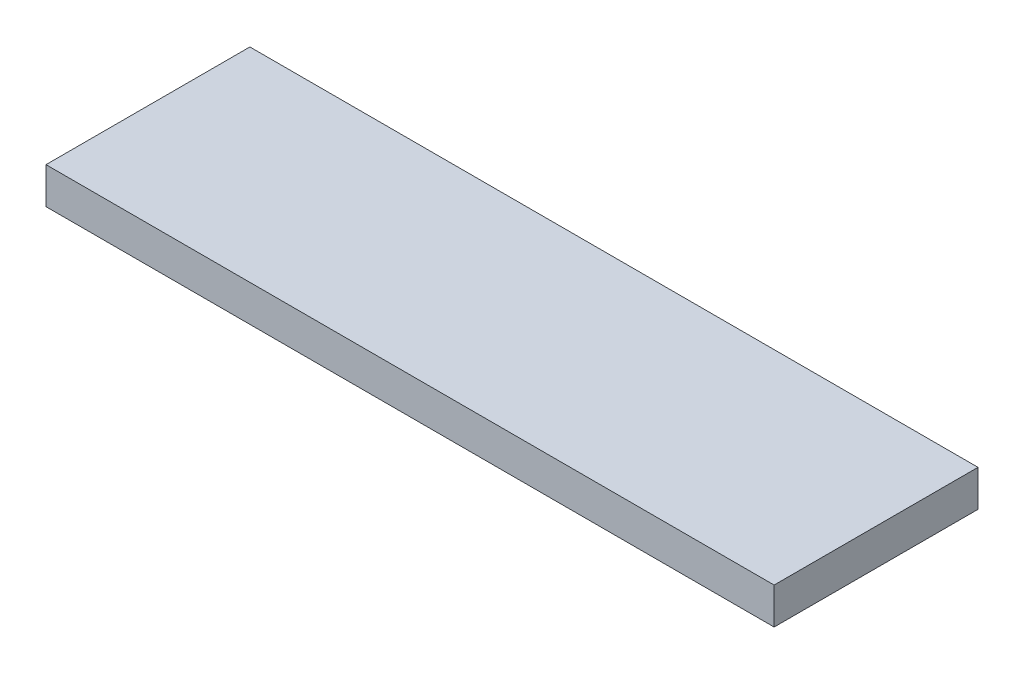
ISO-10303-21;
HEADER;
FILE_DESCRIPTION(('STEP AP214'),'2;1');
FILE_NAME('part.step','',(''),(''),'','','');
FILE_SCHEMA(('AUTOMOTIVE_DESIGN { 1 0 10303 214 1 1 1 1 }'));
ENDSEC;
DATA;
#1=APPLICATION_CONTEXT('core data for automotive mechanical design processes');
#2=APPLICATION_PROTOCOL_DEFINITION('international standard','automotive_design',2000,#1);
#3=PRODUCT_CONTEXT('',#1,'mechanical');
#4=PRODUCT('Part','Part','',(#3));
#5=PRODUCT_RELATED_PRODUCT_CATEGORY('part','',(#4));
#6=PRODUCT_DEFINITION_FORMATION('','',#4);
#7=PRODUCT_DEFINITION_CONTEXT('part definition',#1,'design');
#8=PRODUCT_DEFINITION('design','',#6,#7);
#9=PRODUCT_DEFINITION_SHAPE('','',#8);
#10=(LENGTH_UNIT() NAMED_UNIT(*) SI_UNIT(.MILLI.,.METRE.));
#11=(NAMED_UNIT(*) PLANE_ANGLE_UNIT() SI_UNIT($,.RADIAN.));
#12=(NAMED_UNIT(*) SI_UNIT($,.STERADIAN.) SOLID_ANGLE_UNIT());
#13=UNCERTAINTY_MEASURE_WITH_UNIT(LENGTH_MEASURE(1.E-05),#10,'distance_accuracy_value','');
#14=(GEOMETRIC_REPRESENTATION_CONTEXT(3) GLOBAL_UNCERTAINTY_ASSIGNED_CONTEXT((#13)) GLOBAL_UNIT_ASSIGNED_CONTEXT((#10,
#11,#12)) REPRESENTATION_CONTEXT('',''));
#15=CARTESIAN_POINT('',(0.,0.,0.));
#16=DIRECTION('',(0.,0.,1.));
#17=DIRECTION('',(1.,0.,0.));
#18=AXIS2_PLACEMENT_3D('',#15,#16,#17);
#19=CARTESIAN_POINT('',(9.8,2.22,3.));
#20=DIRECTION('',(-1.,0.,0.));
#21=DIRECTION('',(0.,0.,1.));
#22=AXIS2_PLACEMENT_3D('',#19,#20,#21);
#23=PLANE('',#22);
#24=DIRECTION('',(0.,0.,-1.));
#25=VECTOR('',#24,1.);
#26=CARTESIAN_POINT('',(9.8,2.22,3.));
#27=LINE('',#26,#25);
#28=CARTESIAN_POINT('',(9.8,2.22,3.));
#29=VERTEX_POINT('',#28);
#30=CARTESIAN_POINT('',(9.8,2.22,-1.2));
#31=VERTEX_POINT('',#30);
#32=EDGE_CURVE('E86',#29,#31,#27,.T.);
#33=ORIENTED_EDGE('',*,*,#32,.T.);
#34=DIRECTION('',(0.,-1.,0.));
#35=VECTOR('',#34,1.);
#36=CARTESIAN_POINT('',(9.8,2.22,-1.2));
#37=LINE('',#36,#35);
#38=CARTESIAN_POINT('',(9.8,1.47,-1.2));
#39=VERTEX_POINT('',#38);
#40=EDGE_CURVE('E11',#31,#39,#37,.T.);
#41=ORIENTED_EDGE('',*,*,#40,.T.);
#42=DIRECTION('',(0.,0.,-1.));
#43=VECTOR('',#42,1.);
#44=CARTESIAN_POINT('',(9.8,1.47,3.));
#45=LINE('',#44,#43);
#46=CARTESIAN_POINT('',(9.8,1.47,3.));
#47=VERTEX_POINT('',#46);
#48=EDGE_CURVE('E102',#47,#39,#45,.T.);
#49=ORIENTED_EDGE('',*,*,#48,.F.);
#50=DIRECTION('',(0.,-1.,0.));
#51=VECTOR('',#50,1.);
#52=CARTESIAN_POINT('',(9.8,2.22,3.));
#53=LINE('',#52,#51);
#54=EDGE_CURVE('E89',#29,#47,#53,.T.);
#55=ORIENTED_EDGE('',*,*,#54,.F.);
#56=EDGE_LOOP('',(#33,#41,#49,#55));
#57=FACE_BOUND('',#56,.T.);
#58=ADVANCED_FACE('F16',(#57),#23,.T.);
#59=CARTESIAN_POINT('',(9.8,2.22,-1.2));
#60=DIRECTION('',(0.,0.,-1.));
#61=DIRECTION('',(0.,-1.,0.));
#62=AXIS2_PLACEMENT_3D('',#59,#60,#61);
#63=PLANE('',#62);
#64=DIRECTION('',(1.,0.,0.));
#65=VECTOR('',#64,1.);
#66=CARTESIAN_POINT('',(9.8,2.22,-1.2));
#67=LINE('',#66,#65);
#68=CARTESIAN_POINT('',(24.8,2.22,-1.2));
#69=VERTEX_POINT('',#68);
#70=EDGE_CURVE('E74',#31,#69,#67,.T.);
#71=ORIENTED_EDGE('',*,*,#70,.T.);
#72=DIRECTION('',(0.,-1.,0.));
#73=VECTOR('',#72,1.);
#74=CARTESIAN_POINT('',(24.8,2.22,-1.2));
#75=LINE('',#74,#73);
#76=CARTESIAN_POINT('',(24.8,1.47,-1.2));
#77=VERTEX_POINT('',#76);
#78=EDGE_CURVE('E27',#69,#77,#75,.T.);
#79=ORIENTED_EDGE('',*,*,#78,.T.);
#80=DIRECTION('',(1.,0.,0.));
#81=VECTOR('',#80,1.);
#82=CARTESIAN_POINT('',(9.8,1.47,-1.2));
#83=LINE('',#82,#81);
#84=EDGE_CURVE('E100',#39,#77,#83,.T.);
#85=ORIENTED_EDGE('',*,*,#84,.F.);
#86=ORIENTED_EDGE('',*,*,#40,.F.);
#87=EDGE_LOOP('',(#71,#79,#85,#86));
#88=FACE_BOUND('',#87,.T.);
#89=ADVANCED_FACE('F120',(#88),#63,.T.);
#90=CARTESIAN_POINT('',(24.8,2.22,-1.2));
#91=DIRECTION('',(1.,0.,0.));
#92=DIRECTION('',(0.,1.,0.));
#93=AXIS2_PLACEMENT_3D('',#90,#91,#92);
#94=PLANE('',#93);
#95=DIRECTION('',(0.,0.,1.));
#96=VECTOR('',#95,1.);
#97=CARTESIAN_POINT('',(24.8,2.22,-3.));
#98=LINE('',#97,#96);
#99=CARTESIAN_POINT('',(24.8,2.22,3.));
#100=VERTEX_POINT('',#99);
#101=EDGE_CURVE('E20',#69,#100,#98,.T.);
#102=ORIENTED_EDGE('',*,*,#101,.T.);
#103=DIRECTION('',(0.,-1.,0.));
#104=VECTOR('',#103,1.);
#105=CARTESIAN_POINT('',(24.8,2.22,3.));
#106=LINE('',#105,#104);
#107=CARTESIAN_POINT('',(24.8,1.47,3.));
#108=VERTEX_POINT('',#107);
#109=EDGE_CURVE('E68',#100,#108,#106,.T.);
#110=ORIENTED_EDGE('',*,*,#109,.T.);
#111=DIRECTION('',(0.,0.,1.));
#112=VECTOR('',#111,1.);
#113=CARTESIAN_POINT('',(24.8,1.47,-3.));
#114=LINE('',#113,#112);
#115=EDGE_CURVE('E111',#77,#108,#114,.T.);
#116=ORIENTED_EDGE('',*,*,#115,.F.);
#117=ORIENTED_EDGE('',*,*,#78,.F.);
#118=EDGE_LOOP('',(#102,#110,#116,#117));
#119=FACE_BOUND('',#118,.T.);
#120=ADVANCED_FACE('F18',(#119),#94,.T.);
#121=CARTESIAN_POINT('',(17.3,1.47,0.9));
#122=DIRECTION('',(0.,-1.,0.));
#123=DIRECTION('',(0.,0.,-1.));
#124=AXIS2_PLACEMENT_3D('',#121,#122,#123);
#125=PLANE('',#124);
#126=DIRECTION('',(-1.,0.,0.));
#127=VECTOR('',#126,1.);
#128=CARTESIAN_POINT('',(24.8,1.47,3.));
#129=LINE('',#128,#127);
#130=EDGE_CURVE('E81',#108,#47,#129,.T.);
#131=ORIENTED_EDGE('',*,*,#130,.T.);
#132=ORIENTED_EDGE('',*,*,#48,.T.);
#133=ORIENTED_EDGE('',*,*,#84,.T.);
#134=ORIENTED_EDGE('',*,*,#115,.T.);
#135=EDGE_LOOP('',(#131,#132,#133,#134));
#136=FACE_BOUND('',#135,.T.);
#137=ADVANCED_FACE('F119',(#136),#125,.T.);
#138=CARTESIAN_POINT('',(17.3,2.22,0.9));
#139=DIRECTION('',(0.,1.,0.));
#140=DIRECTION('',(1.,0.,0.));
#141=AXIS2_PLACEMENT_3D('',#138,#139,#140);
#142=PLANE('',#141);
#143=DIRECTION('',(-1.,0.,0.));
#144=VECTOR('',#143,1.);
#145=CARTESIAN_POINT('',(24.8,2.22,3.));
#146=LINE('',#145,#144);
#147=EDGE_CURVE('E79',#100,#29,#146,.T.);
#148=ORIENTED_EDGE('',*,*,#147,.F.);
#149=ORIENTED_EDGE('',*,*,#101,.F.);
#150=ORIENTED_EDGE('',*,*,#70,.F.);
#151=ORIENTED_EDGE('',*,*,#32,.F.);
#152=EDGE_LOOP('',(#148,#149,#150,#151));
#153=FACE_BOUND('',#152,.T.);
#154=ADVANCED_FACE('F84',(#153),#142,.T.);
#155=CARTESIAN_POINT('',(24.8,2.22,3.));
#156=DIRECTION('',(0.,0.,1.));
#157=DIRECTION('',(1.,0.,0.));
#158=AXIS2_PLACEMENT_3D('',#155,#156,#157);
#159=PLANE('',#158);
#160=ORIENTED_EDGE('',*,*,#147,.T.);
#161=ORIENTED_EDGE('',*,*,#54,.T.);
#162=ORIENTED_EDGE('',*,*,#130,.F.);
#163=ORIENTED_EDGE('',*,*,#109,.F.);
#164=EDGE_LOOP('',(#160,#161,#162,#163));
#165=FACE_BOUND('',#164,.T.);
#166=ADVANCED_FACE('F77',(#165),#159,.T.);
#167=CLOSED_SHELL('',(#58,#89,#120,#137,#154,#166));
#168=MANIFOLD_SOLID_BREP('B1',#167);
#169=ADVANCED_BREP_SHAPE_REPRESENTATION('',(#18,#168),#14);
#170=SHAPE_DEFINITION_REPRESENTATION(#9,#169);
ENDSEC;
END-ISO-10303-21;
